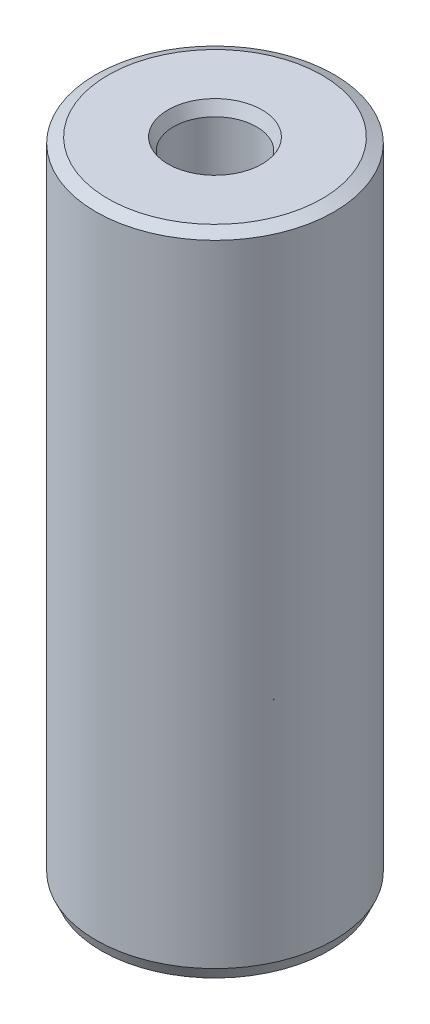
ISO-10303-21;
HEADER;
FILE_DESCRIPTION(('STEP AP214'),'2;1');
FILE_NAME('part.step','',(''),(''),'','','');
FILE_SCHEMA(('AUTOMOTIVE_DESIGN { 1 0 10303 214 1 1 1 1 }'));
ENDSEC;
DATA;
#1=APPLICATION_CONTEXT('core data for automotive mechanical design processes');
#2=APPLICATION_PROTOCOL_DEFINITION('international standard','automotive_design',2000,#1);
#3=PRODUCT_CONTEXT('',#1,'mechanical');
#4=PRODUCT('Part','Part','',(#3));
#5=PRODUCT_RELATED_PRODUCT_CATEGORY('part','',(#4));
#6=PRODUCT_DEFINITION_FORMATION('','',#4);
#7=PRODUCT_DEFINITION_CONTEXT('part definition',#1,'design');
#8=PRODUCT_DEFINITION('design','',#6,#7);
#9=PRODUCT_DEFINITION_SHAPE('','',#8);
#10=(LENGTH_UNIT() NAMED_UNIT(*) SI_UNIT(.MILLI.,.METRE.));
#11=(NAMED_UNIT(*) PLANE_ANGLE_UNIT() SI_UNIT($,.RADIAN.));
#12=(NAMED_UNIT(*) SI_UNIT($,.STERADIAN.) SOLID_ANGLE_UNIT());
#13=UNCERTAINTY_MEASURE_WITH_UNIT(LENGTH_MEASURE(1.E-05),#10,'distance_accuracy_value','');
#14=(GEOMETRIC_REPRESENTATION_CONTEXT(3) GLOBAL_UNCERTAINTY_ASSIGNED_CONTEXT((#13)) GLOBAL_UNIT_ASSIGNED_CONTEXT((#10,
#11,#12)) REPRESENTATION_CONTEXT('',''));
#15=CARTESIAN_POINT('',(0.,0.,0.));
#16=DIRECTION('',(0.,0.,1.));
#17=DIRECTION('',(1.,0.,0.));
#18=AXIS2_PLACEMENT_3D('',#15,#16,#17);
#19=CARTESIAN_POINT('',(0.,27.22051126333,0.));
#20=DIRECTION('',(0.,-1.,0.));
#21=DIRECTION('',(0.,0.,-1.));
#22=AXIS2_PLACEMENT_3D('',#19,#20,#21);
#23=CYLINDRICAL_SURFACE('',#22,5.);
#24=CARTESIAN_POINT('',(0.,0.503091617660274,0.));
#25=DIRECTION('',(0.,1.,0.));
#26=DIRECTION('',(0.,0.,1.));
#27=AXIS2_PLACEMENT_3D('',#24,#25,#26);
#28=CIRCLE('',#27,5.);
#29=CARTESIAN_POINT('',(0.,0.503091617660274,5.));
#30=VERTEX_POINT('',#29);
#31=EDGE_CURVE('E10',#30,#30,#28,.T.);
#32=ORIENTED_EDGE('',*,*,#31,.T.);
#33=EDGE_LOOP('',(#32));
#34=FACE_BOUND('',#33,.T.);
#35=CARTESIAN_POINT('',(0.,26.9931330455437,0.));
#36=DIRECTION('',(0.,1.,0.));
#37=DIRECTION('',(0.,0.,1.));
#38=AXIS2_PLACEMENT_3D('',#35,#36,#37);
#39=CIRCLE('',#38,5.);
#40=CARTESIAN_POINT('',(0.,26.9931330455437,-5.));
#41=VERTEX_POINT('',#40);
#42=EDGE_CURVE('E50',#41,#41,#39,.F.);
#43=ORIENTED_EDGE('',*,*,#42,.T.);
#44=EDGE_LOOP('',(#43));
#45=FACE_BOUND('',#44,.T.);
#46=ADVANCED_FACE('F39',(#34,#45),#23,.T.);
#47=CARTESIAN_POINT('',(0.,27.22051126333,0.));
#48=DIRECTION('',(0.,1.,0.));
#49=DIRECTION('',(0.,0.,1.));
#50=AXIS2_PLACEMENT_3D('',#47,#48,#49);
#51=PLANE('',#50);
#52=CARTESIAN_POINT('',(0.,27.22051126333,0.));
#53=DIRECTION('',(0.,1.,0.));
#54=DIRECTION('',(0.,0.,1.));
#55=AXIS2_PLACEMENT_3D('',#52,#53,#54);
#56=CIRCLE('',#55,1.97448859576121);
#57=CARTESIAN_POINT('',(0.,27.22051126333,1.97448859576121));
#58=VERTEX_POINT('',#57);
#59=EDGE_CURVE('E58',#58,#58,#56,.F.);
#60=ORIENTED_EDGE('',*,*,#59,.T.);
#61=EDGE_LOOP('',(#60));
#62=FACE_BOUND('',#61,.T.);
#63=CARTESIAN_POINT('',(0.,27.22051126333,0.));
#64=DIRECTION('',(0.,1.,0.));
#65=DIRECTION('',(0.,0.,1.));
#66=AXIS2_PLACEMENT_3D('',#63,#64,#65);
#67=CIRCLE('',#66,4.49690838233971);
#68=CARTESIAN_POINT('',(0.,27.22051126333,-4.49690838233971));
#69=VERTEX_POINT('',#68);
#70=EDGE_CURVE('E61',#69,#69,#67,.T.);
#71=ORIENTED_EDGE('',*,*,#70,.T.);
#72=EDGE_LOOP('',(#71));
#73=FACE_BOUND('',#72,.T.);
#74=ADVANCED_FACE('F88',(#62,#73),#51,.T.);
#75=CARTESIAN_POINT('',(0.,0.,0.));
#76=DIRECTION('',(0.,1.,0.));
#77=DIRECTION('',(0.,0.,1.));
#78=AXIS2_PLACEMENT_3D('',#75,#76,#77);
#79=PLANE('',#78);
#80=CARTESIAN_POINT('',(0.,0.,0.));
#81=DIRECTION('',(0.,1.,0.));
#82=DIRECTION('',(0.,0.,1.));
#83=AXIS2_PLACEMENT_3D('',#80,#81,#82);
#84=CIRCLE('',#83,2.25020199563525);
#85=CARTESIAN_POINT('',(0.,0.,-2.25020199563525));
#86=VERTEX_POINT('',#85);
#87=EDGE_CURVE('E51',#86,#86,#84,.T.);
#88=ORIENTED_EDGE('',*,*,#87,.T.);
#89=EDGE_LOOP('',(#88));
#90=FACE_BOUND('',#89,.T.);
#91=CARTESIAN_POINT('',(0.,0.,0.));
#92=DIRECTION('',(0.,1.,0.));
#93=DIRECTION('',(0.,0.,1.));
#94=AXIS2_PLACEMENT_3D('',#91,#92,#93);
#95=CIRCLE('',#94,4.77262178221375);
#96=CARTESIAN_POINT('',(0.,0.,4.77262178221375));
#97=VERTEX_POINT('',#96);
#98=EDGE_CURVE('E54',#97,#97,#95,.F.);
#99=ORIENTED_EDGE('',*,*,#98,.T.);
#100=EDGE_LOOP('',(#99));
#101=FACE_BOUND('',#100,.T.);
#102=ADVANCED_FACE('F83',(#90,#101),#79,.F.);
#103=CARTESIAN_POINT('',(0.,27.22051126333,0.));
#104=DIRECTION('',(0.,-1.,0.));
#105=DIRECTION('',(0.,0.,-1.));
#106=AXIS2_PLACEMENT_3D('',#103,#104,#105);
#107=CYLINDRICAL_SURFACE('',#106,1.74711037797496);
#108=CARTESIAN_POINT('',(0.,26.7174196456697,0.));
#109=DIRECTION('',(0.,1.,0.));
#110=DIRECTION('',(0.,0.,1.));
#111=AXIS2_PLACEMENT_3D('',#108,#109,#110);
#112=CIRCLE('',#111,1.74711037797496);
#113=CARTESIAN_POINT('',(0.,26.7174196456697,1.74711037797496));
#114=VERTEX_POINT('',#113);
#115=EDGE_CURVE('E67',#114,#114,#112,.T.);
#116=ORIENTED_EDGE('',*,*,#115,.T.);
#117=EDGE_LOOP('',(#116));
#118=FACE_BOUND('',#117,.T.);
#119=CARTESIAN_POINT('',(0.,0.227378217786262,0.));
#120=DIRECTION('',(0.,1.,0.));
#121=DIRECTION('',(0.,0.,1.));
#122=AXIS2_PLACEMENT_3D('',#119,#120,#121);
#123=CIRCLE('',#122,1.74711037797496);
#124=CARTESIAN_POINT('',(0.,0.227378217786262,-1.74711037797496));
#125=VERTEX_POINT('',#124);
#126=EDGE_CURVE('E69',#125,#125,#123,.F.);
#127=ORIENTED_EDGE('',*,*,#126,.T.);
#128=EDGE_LOOP('',(#127));
#129=FACE_BOUND('',#128,.T.);
#130=ADVANCED_FACE('F71',(#118,#129),#107,.F.);
#131=CARTESIAN_POINT('',(0.,26.7174196456697,0.));
#132=DIRECTION('',(0.,1.,0.));
#133=DIRECTION('',(0.,0.,1.));
#134=AXIS2_PLACEMENT_3D('',#131,#132,#133);
#135=CONICAL_SURFACE('',#134,1.74711037797496,0.424484203143039);
#136=ORIENTED_EDGE('',*,*,#59,.F.);
#137=EDGE_LOOP('',(#136));
#138=FACE_BOUND('',#137,.T.);
#139=ORIENTED_EDGE('',*,*,#115,.F.);
#140=EDGE_LOOP('',(#139));
#141=FACE_BOUND('',#140,.T.);
#142=ADVANCED_FACE('F77',(#138,#141),#135,.F.);
#143=CARTESIAN_POINT('',(0.,0.,0.));
#144=DIRECTION('',(0.,-1.,0.));
#145=DIRECTION('',(0.,0.,-1.));
#146=AXIS2_PLACEMENT_3D('',#143,#144,#145);
#147=CONICAL_SURFACE('',#146,2.25020199563525,1.14631212365185);
#148=CARTESIAN_POINT('',(0.,0.227378217786262,-1.74711037797496));
#149=CARTESIAN_POINT('',(0.,0.225009694684321,-1.75235091565892));
#150=CARTESIAN_POINT('',(0.,0.222641171582381,-1.75759145334288));
#151=CARTESIAN_POINT('',(0.,0.217904125378501,-1.7680725287108));
#152=CARTESIAN_POINT('',(0.,0.21553560227656,-1.77331306639476));
#153=CARTESIAN_POINT('',(0.,0.21079855607268,-1.78379414176269));
#154=CARTESIAN_POINT('',(0.,0.20843003297074,-1.78903467944665));
#155=CARTESIAN_POINT('',(0.,0.203692986766859,-1.79951575481457));
#156=CARTESIAN_POINT('',(0.,0.201324463664919,-1.80475629249853));
#157=CARTESIAN_POINT('',(0.,0.196587417461039,-1.81523736786645));
#158=CARTESIAN_POINT('',(0.,0.194218894359098,-1.82047790555041));
#159=CARTESIAN_POINT('',(0.,0.189481848155218,-1.83095898091834));
#160=CARTESIAN_POINT('',(0.,0.187113325053278,-1.8361995186023));
#161=CARTESIAN_POINT('',(0.,0.182376278849397,-1.84668059397022));
#162=CARTESIAN_POINT('',(0.,0.180007755747457,-1.85192113165418));
#163=CARTESIAN_POINT('',(0.,0.175270709543577,-1.86240220702211));
#164=CARTESIAN_POINT('',(0.,0.172902186441636,-1.86764274470607));
#165=CARTESIAN_POINT('',(0.,0.168165140237756,-1.87812382007399));
#166=CARTESIAN_POINT('',(0.,0.165796617135816,-1.88336435775795));
#167=CARTESIAN_POINT('',(0.,0.161059570931935,-1.89384543312587));
#168=CARTESIAN_POINT('',(0.,0.158691047829995,-1.89908597080984));
#169=CARTESIAN_POINT('',(0.,0.153954001626115,-1.90956704617776));
#170=CARTESIAN_POINT('',(0.,0.151585478524174,-1.91480758386172));
#171=CARTESIAN_POINT('',(0.,0.146848432320294,-1.92528865922964));
#172=CARTESIAN_POINT('',(0.,0.144479909218354,-1.9305291969136));
#173=CARTESIAN_POINT('',(0.,0.139742863014473,-1.94101027228153));
#174=CARTESIAN_POINT('',(0.,0.137374339912533,-1.94625080996549));
#175=CARTESIAN_POINT('',(0.,0.132637293708653,-1.95673188533341));
#176=CARTESIAN_POINT('',(0.,0.130268770606712,-1.96197242301737));
#177=CARTESIAN_POINT('',(0.,0.125531724402832,-1.97245349838529));
#178=CARTESIAN_POINT('',(0.,0.123163201300892,-1.97769403606926));
#179=CARTESIAN_POINT('',(0.,0.118426155097011,-1.98817511143718));
#180=CARTESIAN_POINT('',(0.,0.116057631995071,-1.99341564912114));
#181=CARTESIAN_POINT('',(0.,0.111320585791191,-2.00389672448906));
#182=CARTESIAN_POINT('',(0.,0.10895206268925,-2.00913726217303));
#183=CARTESIAN_POINT('',(0.,0.10421501648537,-2.01961833754095));
#184=CARTESIAN_POINT('',(0.,0.10184649338343,-2.02485887522491));
#185=CARTESIAN_POINT('',(0.,0.0971094471795492,-2.03533995059283));
#186=CARTESIAN_POINT('',(0.,0.094740924077609,-2.04058048827679));
#187=CARTESIAN_POINT('',(0.,0.0900038778737285,-2.05106156364472));
#188=CARTESIAN_POINT('',(0.,0.0876353547717883,-2.05630210132868));
#189=CARTESIAN_POINT('',(0.,0.0828983085679079,-2.0667831766966));
#190=CARTESIAN_POINT('',(0.,0.0805297854659676,-2.07202371438056));
#191=CARTESIAN_POINT('',(0.,0.0757927392620872,-2.08250478974848));
#192=CARTESIAN_POINT('',(0.,0.073424216160147,-2.08774532743245));
#193=CARTESIAN_POINT('',(0.,0.0686871699562665,-2.09822640280037));
#194=CARTESIAN_POINT('',(0.,0.0663186468543263,-2.10346694048433));
#195=CARTESIAN_POINT('',(0.,0.0615816006504458,-2.11394801585225));
#196=CARTESIAN_POINT('',(0.,0.0592130775485056,-2.11918855353621));
#197=CARTESIAN_POINT('',(0.,0.0544760313446252,-2.12966962890414));
#198=CARTESIAN_POINT('',(0.,0.0521075082426849,-2.1349101665881));
#199=CARTESIAN_POINT('',(0.,0.0473704620388044,-2.14539124195602));
#200=CARTESIAN_POINT('',(0.,0.0450019389368643,-2.15063177963998));
#201=CARTESIAN_POINT('',(0.,0.0402648927329838,-2.1611128550079));
#202=CARTESIAN_POINT('',(0.,0.0378963696310436,-2.16635339269187));
#203=CARTESIAN_POINT('',(0.,0.0331593234271631,-2.17683446805979));
#204=CARTESIAN_POINT('',(0.,0.0307908003252229,-2.18207500574375));
#205=CARTESIAN_POINT('',(0.,0.0260537541213425,-2.19255608111167));
#206=CARTESIAN_POINT('',(0.,0.0236852310194023,-2.19779661879563));
#207=CARTESIAN_POINT('',(0.,0.0189481848155218,-2.20827769416356));
#208=CARTESIAN_POINT('',(0.,0.0165796617135816,-2.21351823184752));
#209=CARTESIAN_POINT('',(0.,0.0118426155097011,-2.22399930721544));
#210=CARTESIAN_POINT('',(0.,0.00947409240776088,-2.2292398448994));
#211=CARTESIAN_POINT('',(0.,0.00473704620388047,-2.23972092026733));
#212=CARTESIAN_POINT('',(0.,0.00236852310194026,-2.24496145795129));
#213=CARTESIAN_POINT('',(0.,0.,-2.25020199563525));
#214=B_SPLINE_CURVE_WITH_KNOTS('',3,(#148,#149,#150,#151,#152,#153,#154,#155,#156,#157,#158,
#159,#160,#161,#162,#163,#164,#165,#166,#167,#168,#169,#170,#171,#172,#173,#174,#175,#176,#177,
#178,#179,#180,#181,#182,#183,#184,#185,#186,#187,#188,#189,#190,#191,#192,#193,#194,#195,#196,
#197,#198,#199,#200,#201,#202,#203,#204,#205,#206,#207,#208,#209,#210,#211,#212,#213),
.UNSPECIFIED.,.F.,.F.,(4,2,2,2,2,2,2,2,2,2,2,2,2,2,2,2,2,2,2,2,2,2,2,2,2,2,2,2,2,2,2,2,4),(0.,
0.0172527746207095,0.0345055492414188,0.0517583238621283,0.0690110984828375,0.086263873103547,
0.103516647724257,0.120769422344966,0.138022196965675,0.155274971586385,0.172527746207094,
0.189780520827803,0.207033295448513,0.224286070069222,0.241538844689932,0.258791619310641,
0.27604439393135,0.29329716855206,0.310549943172769,0.327802717793478,0.345055492414188,
0.362308267034897,0.379561041655607,0.396813816276316,0.414066590897026,0.431319365517735,
0.448572140138444,0.465824914759154,0.483077689379863,0.500330464000573,0.517583238621282,
0.534836013241991,0.552088787862701),.UNSPECIFIED.);
#215=EDGE_CURVE('BSEAM73',#125,#86,#214,.T.);
#216=ORIENTED_EDGE('',*,*,#126,.F.);
#217=ORIENTED_EDGE('',*,*,#87,.F.);
#218=ORIENTED_EDGE('',*,*,#215,.T.);
#219=ORIENTED_EDGE('',*,*,#215,.F.);
#220=EDGE_LOOP('',(#216,#218,#217,#219));
#221=FACE_BOUND('',#220,.T.);
#222=ADVANCED_FACE('F73',(#221),#147,.F.);
#223=CARTESIAN_POINT('',(0.,0.503091617660274,0.));
#224=DIRECTION('',(0.,1.,0.));
#225=DIRECTION('',(0.,0.,1.));
#226=AXIS2_PLACEMENT_3D('',#223,#224,#225);
#227=CONICAL_SURFACE('',#226,5.,0.424484203143044);
#228=ORIENTED_EDGE('',*,*,#98,.F.);
#229=EDGE_LOOP('',(#228));
#230=FACE_BOUND('',#229,.T.);
#231=ORIENTED_EDGE('',*,*,#31,.F.);
#232=EDGE_LOOP('',(#231));
#233=FACE_BOUND('',#232,.T.);
#234=ADVANCED_FACE('F76',(#230,#233),#227,.T.);
#235=CARTESIAN_POINT('',(0.,27.22051126333,0.));
#236=DIRECTION('',(0.,-1.,0.));
#237=DIRECTION('',(0.,0.,-1.));
#238=AXIS2_PLACEMENT_3D('',#235,#236,#237);
#239=CONICAL_SURFACE('',#238,4.49690838233971,1.14631212365185);
#240=CARTESIAN_POINT('',(0.,26.9931330455437,-5.));
#241=CARTESIAN_POINT('',(0.,26.9955015686456,-4.99475946231604));
#242=CARTESIAN_POINT('',(0.,26.9978700917476,-4.98951892463208));
#243=CARTESIAN_POINT('',(0.,27.0026071379515,-4.97903784926416));
#244=CARTESIAN_POINT('',(0.,27.0049756610534,-4.9737973115802));
#245=CARTESIAN_POINT('',(0.,27.0097127072573,-4.96331623621227));
#246=CARTESIAN_POINT('',(0.,27.0120812303592,-4.95807569852831));
#247=CARTESIAN_POINT('',(0.,27.0168182765631,-4.94759462316039));
#248=CARTESIAN_POINT('',(0.,27.0191867996651,-4.94235408547643));
#249=CARTESIAN_POINT('',(0.,27.0239238458689,-4.93187301010851));
#250=CARTESIAN_POINT('',(0.,27.0262923689709,-4.92663247242454));
#251=CARTESIAN_POINT('',(0.,27.0310294151747,-4.91615139705662));
#252=CARTESIAN_POINT('',(0.,27.0333979382767,-4.91091085937266));
#253=CARTESIAN_POINT('',(0.,27.0381349844806,-4.90042978400474));
#254=CARTESIAN_POINT('',(0.,27.0405035075825,-4.89518924632078));
#255=CARTESIAN_POINT('',(0.,27.0452405537864,-4.88470817095285));
#256=CARTESIAN_POINT('',(0.,27.0476090768883,-4.87946763326889));
#257=CARTESIAN_POINT('',(0.,27.0523461230922,-4.86898655790097));
#258=CARTESIAN_POINT('',(0.,27.0547146461941,-4.86374602021701));
#259=CARTESIAN_POINT('',(0.,27.059451692398,-4.85326494484908));
#260=CARTESIAN_POINT('',(0.,27.0618202155,-4.84802440716512));
#261=CARTESIAN_POINT('',(0.,27.0665572617039,-4.8375433317972));
#262=CARTESIAN_POINT('',(0.,27.0689257848058,-4.83230279411324));
#263=CARTESIAN_POINT('',(0.,27.0736628310097,-4.82182171874532));
#264=CARTESIAN_POINT('',(0.,27.0760313541116,-4.81658118106136));
#265=CARTESIAN_POINT('',(0.,27.0807684003155,-4.80610010569343));
#266=CARTESIAN_POINT('',(0.,27.0831369234174,-4.80085956800947));
#267=CARTESIAN_POINT('',(0.,27.0878739696213,-4.79037849264155));
#268=CARTESIAN_POINT('',(0.,27.0902424927233,-4.78513795495759));
#269=CARTESIAN_POINT('',(0.,27.0949795389271,-4.77465687958966));
#270=CARTESIAN_POINT('',(0.,27.0973480620291,-4.7694163419057));
#271=CARTESIAN_POINT('',(0.,27.102085108233,-4.75893526653778));
#272=CARTESIAN_POINT('',(0.,27.1044536313349,-4.75369472885382));
#273=CARTESIAN_POINT('',(0.,27.1091906775388,-4.7432136534859));
#274=CARTESIAN_POINT('',(0.,27.1115592006407,-4.73797311580193));
#275=CARTESIAN_POINT('',(0.,27.1162962468446,-4.72749204043401));
#276=CARTESIAN_POINT('',(0.,27.1186647699465,-4.72225150275005));
#277=CARTESIAN_POINT('',(0.,27.1234018161504,-4.71177042738213));
#278=CARTESIAN_POINT('',(0.,27.1257703392524,-4.70652988969817));
#279=CARTESIAN_POINT('',(0.,27.1305073854562,-4.69604881433024));
#280=CARTESIAN_POINT('',(0.,27.1328759085582,-4.69080827664628));
#281=CARTESIAN_POINT('',(0.,27.1376129547621,-4.68032720127836));
#282=CARTESIAN_POINT('',(0.,27.139981477864,-4.6750866635944));
#283=CARTESIAN_POINT('',(0.,27.1447185240679,-4.66460558822647));
#284=CARTESIAN_POINT('',(0.,27.1470870471698,-4.65936505054251));
#285=CARTESIAN_POINT('',(0.,27.1518240933737,-4.64888397517459));
#286=CARTESIAN_POINT('',(0.,27.1541926164756,-4.64364343749063));
#287=CARTESIAN_POINT('',(0.,27.1589296626795,-4.63316236212271));
#288=CARTESIAN_POINT('',(0.,27.1612981857815,-4.62792182443874));
#289=CARTESIAN_POINT('',(0.,27.1660352319853,-4.61744074907082));
#290=CARTESIAN_POINT('',(0.,27.1684037550873,-4.61220021138686));
#291=CARTESIAN_POINT('',(0.,27.1731408012912,-4.60171913601894));
#292=CARTESIAN_POINT('',(0.,27.1755093243931,-4.59647859833498));
#293=CARTESIAN_POINT('',(0.,27.180246370597,-4.58599752296705));
#294=CARTESIAN_POINT('',(0.,27.1826148936989,-4.58075698528309));
#295=CARTESIAN_POINT('',(0.,27.1873519399028,-4.57027590991517));
#296=CARTESIAN_POINT('',(0.,27.1897204630047,-4.56503537223121));
#297=CARTESIAN_POINT('',(0.,27.1944575092086,-4.55455429686329));
#298=CARTESIAN_POINT('',(0.,27.1968260323106,-4.54931375917932));
#299=CARTESIAN_POINT('',(0.,27.2015630785144,-4.5388326838114));
#300=CARTESIAN_POINT('',(0.,27.2039316016164,-4.53359214612744));
#301=CARTESIAN_POINT('',(0.,27.2086686478203,-4.52311107075952));
#302=CARTESIAN_POINT('',(0.,27.2110371709222,-4.51787053307556));
#303=CARTESIAN_POINT('',(0.,27.2157742171261,-4.50738945770763));
#304=CARTESIAN_POINT('',(0.,27.218142740228,-4.50214892002367));
#305=CARTESIAN_POINT('',(0.,27.22051126333,-4.49690838233971));
#306=B_SPLINE_CURVE_WITH_KNOTS('',3,(#240,#241,#242,#243,#244,#245,#246,#247,#248,#249,#250,
#251,#252,#253,#254,#255,#256,#257,#258,#259,#260,#261,#262,#263,#264,#265,#266,#267,#268,#269,
#270,#271,#272,#273,#274,#275,#276,#277,#278,#279,#280,#281,#282,#283,#284,#285,#286,#287,#288,
#289,#290,#291,#292,#293,#294,#295,#296,#297,#298,#299,#300,#301,#302,#303,#304,#305),
.UNSPECIFIED.,.F.,.F.,(4,2,2,2,2,2,2,2,2,2,2,2,2,2,2,2,2,2,2,2,2,2,2,2,2,2,2,2,2,2,2,2,4),(0.,
0.0172527746207092,0.0345055492414182,0.0517583238621281,0.0690110984828379,0.0862638731035463,
0.103516647724256,0.120769422344966,0.138022196965676,0.155274971586384,0.172527746207094,
0.189780520827804,0.207033295448514,0.224286070069222,0.241538844689932,0.258791619310642,
0.276044393931352,0.29329716855206,0.31054994317277,0.32780271779348,0.34505549241419,
0.362308267034898,0.379561041655608,0.396813816276318,0.414066590897028,0.431319365517736,
0.448572140138446,0.465824914759156,0.483077689379866,0.500330464000574,0.517583238621284,
0.534836013241994,0.552088787862704),.UNSPECIFIED.);
#307=EDGE_CURVE('BSEAM45',#41,#69,#306,.T.);
#308=ORIENTED_EDGE('',*,*,#42,.F.);
#309=ORIENTED_EDGE('',*,*,#70,.F.);
#310=ORIENTED_EDGE('',*,*,#307,.T.);
#311=ORIENTED_EDGE('',*,*,#307,.F.);
#312=EDGE_LOOP('',(#308,#310,#309,#311));
#313=FACE_BOUND('',#312,.T.);
#314=ADVANCED_FACE('F45',(#313),#239,.T.);
#315=CLOSED_SHELL('',(#46,#74,#102,#130,#142,#222,#234,#314));
#316=MANIFOLD_SOLID_BREP('B2',#315);
#317=ADVANCED_BREP_SHAPE_REPRESENTATION('',(#18,#316),#14);
#318=SHAPE_DEFINITION_REPRESENTATION(#9,#317);
ENDSEC;
END-ISO-10303-21;
